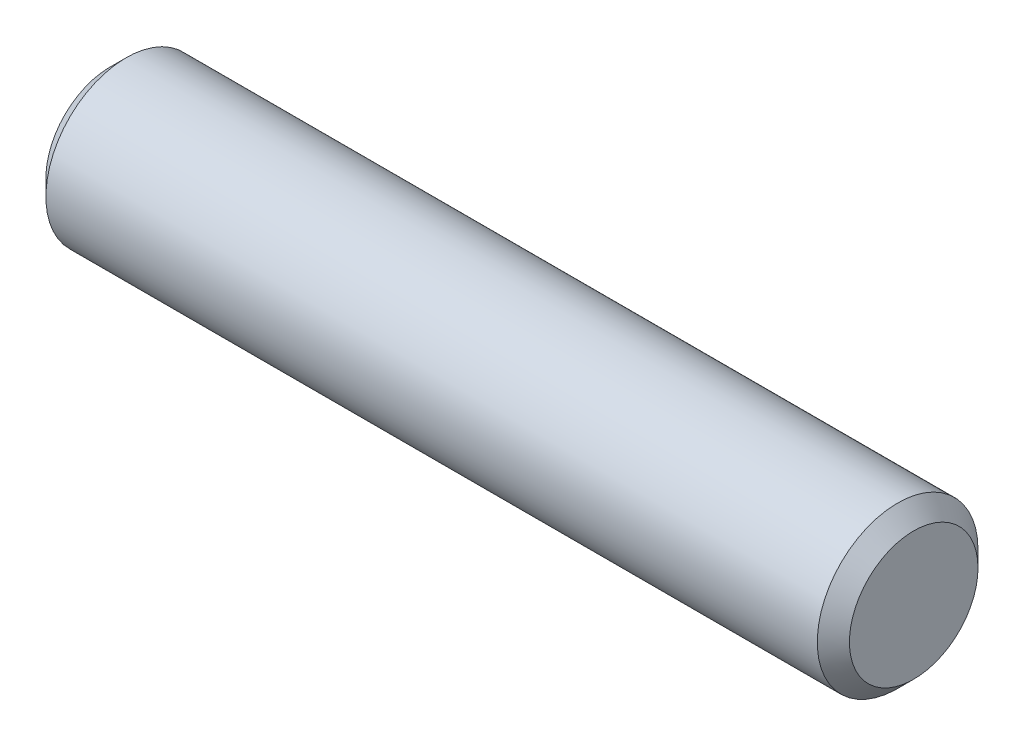
ISO-10303-21;
HEADER;
FILE_DESCRIPTION(('STEP AP214'),'2;1');
FILE_NAME('part.step','',(''),(''),'','','');
FILE_SCHEMA(('AUTOMOTIVE_DESIGN { 1 0 10303 214 1 1 1 1 }'));
ENDSEC;
DATA;
#1=APPLICATION_CONTEXT('core data for automotive mechanical design processes');
#2=APPLICATION_PROTOCOL_DEFINITION('international standard','automotive_design',2000,#1);
#3=PRODUCT_CONTEXT('',#1,'mechanical');
#4=PRODUCT('Part','Part','',(#3));
#5=PRODUCT_RELATED_PRODUCT_CATEGORY('part','',(#4));
#6=PRODUCT_DEFINITION_FORMATION('','',#4);
#7=PRODUCT_DEFINITION_CONTEXT('part definition',#1,'design');
#8=PRODUCT_DEFINITION('design','',#6,#7);
#9=PRODUCT_DEFINITION_SHAPE('','',#8);
#10=(LENGTH_UNIT() NAMED_UNIT(*) SI_UNIT(.MILLI.,.METRE.));
#11=(NAMED_UNIT(*) PLANE_ANGLE_UNIT() SI_UNIT($,.RADIAN.));
#12=(NAMED_UNIT(*) SI_UNIT($,.STERADIAN.) SOLID_ANGLE_UNIT());
#13=UNCERTAINTY_MEASURE_WITH_UNIT(LENGTH_MEASURE(1.E-05),#10,'distance_accuracy_value','');
#14=(GEOMETRIC_REPRESENTATION_CONTEXT(3) GLOBAL_UNCERTAINTY_ASSIGNED_CONTEXT((#13)) GLOBAL_UNIT_ASSIGNED_CONTEXT((#10,
#11,#12)) REPRESENTATION_CONTEXT('',''));
#15=CARTESIAN_POINT('',(0.,0.,0.));
#16=DIRECTION('',(0.,0.,1.));
#17=DIRECTION('',(1.,0.,0.));
#18=AXIS2_PLACEMENT_3D('',#15,#16,#17);
#19=CARTESIAN_POINT('',(-15.875,0.,0.));
#20=DIRECTION('',(1.,0.,0.));
#21=DIRECTION('',(0.,0.,-1.));
#22=AXIS2_PLACEMENT_3D('',#19,#20,#21);
#23=CYLINDRICAL_SURFACE('',#22,3.175);
#24=CARTESIAN_POINT('',(15.24,0.,0.));
#25=DIRECTION('',(1.,0.,0.));
#26=DIRECTION('',(0.,0.,-1.));
#27=AXIS2_PLACEMENT_3D('',#24,#25,#26);
#28=CIRCLE('',#27,3.175);
#29=CARTESIAN_POINT('',(15.24,0.,-3.175));
#30=VERTEX_POINT('',#29);
#31=EDGE_CURVE('E37',#30,#30,#28,.F.);
#32=ORIENTED_EDGE('',*,*,#31,.T.);
#33=EDGE_LOOP('',(#32));
#34=FACE_BOUND('',#33,.T.);
#35=CARTESIAN_POINT('',(-15.24,0.,0.));
#36=DIRECTION('',(1.,0.,0.));
#37=DIRECTION('',(0.,0.,-1.));
#38=AXIS2_PLACEMENT_3D('',#35,#36,#37);
#39=CIRCLE('',#38,3.175);
#40=CARTESIAN_POINT('',(-15.24,0.,-3.175));
#41=VERTEX_POINT('',#40);
#42=EDGE_CURVE('E41',#41,#41,#39,.T.);
#43=ORIENTED_EDGE('',*,*,#42,.T.);
#44=EDGE_LOOP('',(#43));
#45=FACE_BOUND('',#44,.T.);
#46=ADVANCED_FACE('F30',(#34,#45),#23,.T.);
#47=CARTESIAN_POINT('',(-15.875,0.,0.));
#48=DIRECTION('',(1.,0.,0.));
#49=DIRECTION('',(0.,0.,-1.));
#50=AXIS2_PLACEMENT_3D('',#47,#48,#49);
#51=PLANE('',#50);
#52=CARTESIAN_POINT('',(-15.875,0.,0.));
#53=DIRECTION('',(1.,0.,0.));
#54=DIRECTION('',(0.,0.,-1.));
#55=AXIS2_PLACEMENT_3D('',#52,#53,#54);
#56=CIRCLE('',#55,2.54);
#57=CARTESIAN_POINT('',(-15.875,0.,-2.54));
#58=VERTEX_POINT('',#57);
#59=EDGE_CURVE('E10',#58,#58,#56,.F.);
#60=ORIENTED_EDGE('',*,*,#59,.T.);
#61=EDGE_LOOP('',(#60));
#62=FACE_BOUND('',#61,.T.);
#63=ADVANCED_FACE('F61',(#62),#51,.F.);
#64=CARTESIAN_POINT('',(15.875,0.,0.));
#65=DIRECTION('',(1.,0.,0.));
#66=DIRECTION('',(0.,0.,-1.));
#67=AXIS2_PLACEMENT_3D('',#64,#65,#66);
#68=PLANE('',#67);
#69=CARTESIAN_POINT('',(15.875,0.,0.));
#70=DIRECTION('',(1.,0.,0.));
#71=DIRECTION('',(0.,0.,-1.));
#72=AXIS2_PLACEMENT_3D('',#69,#70,#71);
#73=CIRCLE('',#72,2.54);
#74=CARTESIAN_POINT('',(15.875,0.,-2.54));
#75=VERTEX_POINT('',#74);
#76=EDGE_CURVE('E45',#75,#75,#73,.T.);
#77=ORIENTED_EDGE('',*,*,#76,.T.);
#78=EDGE_LOOP('',(#77));
#79=FACE_BOUND('',#78,.T.);
#80=ADVANCED_FACE('F51',(#79),#68,.T.);
#81=CARTESIAN_POINT('',(15.875,0.,0.));
#82=DIRECTION('',(-1.,0.,0.));
#83=DIRECTION('',(0.,0.,1.));
#84=AXIS2_PLACEMENT_3D('',#81,#82,#83);
#85=CONICAL_SURFACE('',#84,2.54,0.785398163397445);
#86=ORIENTED_EDGE('',*,*,#31,.F.);
#87=EDGE_LOOP('',(#86));
#88=FACE_BOUND('',#87,.T.);
#89=ORIENTED_EDGE('',*,*,#76,.F.);
#90=EDGE_LOOP('',(#89));
#91=FACE_BOUND('',#90,.T.);
#92=ADVANCED_FACE('F53',(#88,#91),#85,.T.);
#93=CARTESIAN_POINT('',(-15.24,0.,0.));
#94=DIRECTION('',(1.,0.,0.));
#95=DIRECTION('',(0.,0.,-1.));
#96=AXIS2_PLACEMENT_3D('',#93,#94,#95);
#97=CONICAL_SURFACE('',#96,3.175,0.78539816339745);
#98=ORIENTED_EDGE('',*,*,#59,.F.);
#99=EDGE_LOOP('',(#98));
#100=FACE_BOUND('',#99,.T.);
#101=ORIENTED_EDGE('',*,*,#42,.F.);
#102=EDGE_LOOP('',(#101));
#103=FACE_BOUND('',#102,.T.);
#104=ADVANCED_FACE('F32',(#100,#103),#97,.T.);
#105=CLOSED_SHELL('',(#46,#63,#80,#92,#104));
#106=MANIFOLD_SOLID_BREP('B2',#105);
#107=ADVANCED_BREP_SHAPE_REPRESENTATION('',(#18,#106),#14);
#108=SHAPE_DEFINITION_REPRESENTATION(#9,#107);
ENDSEC;
END-ISO-10303-21;
